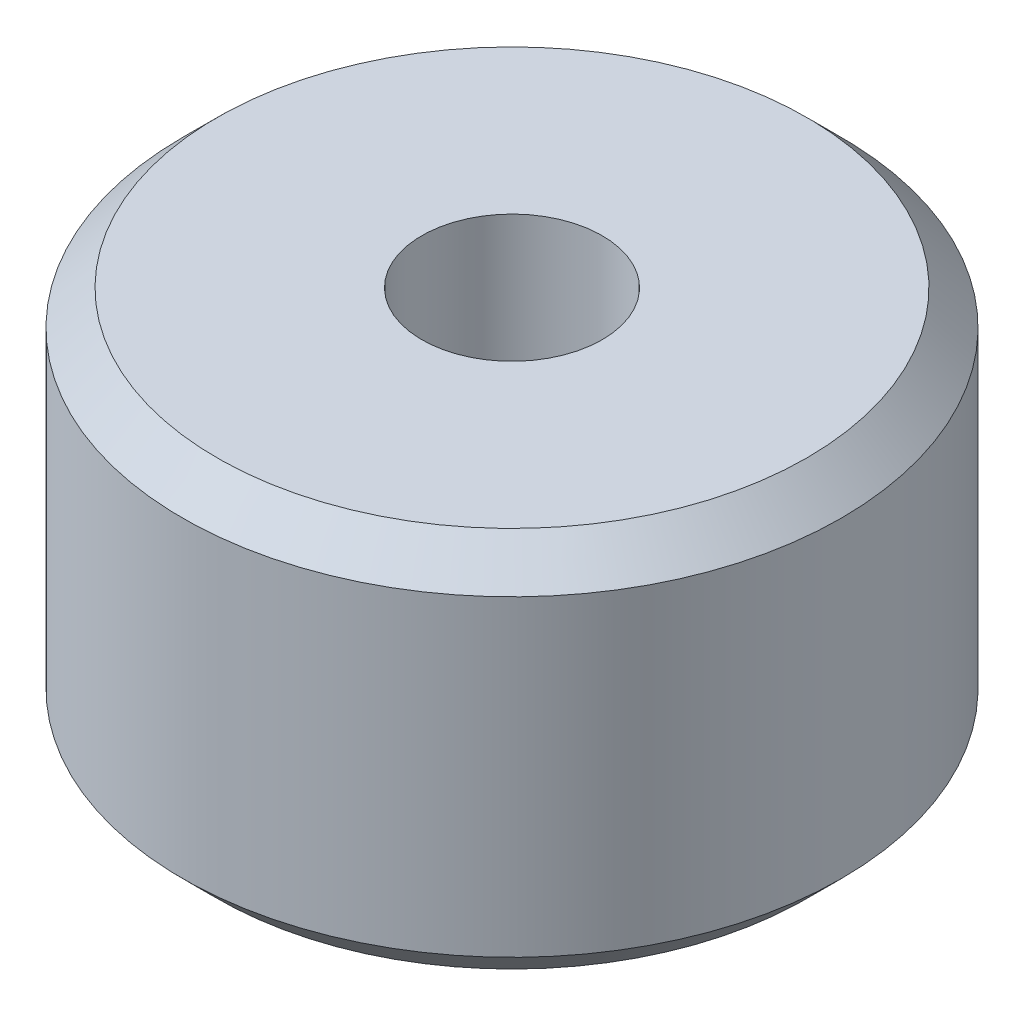
ISO-10303-21;
HEADER;
FILE_DESCRIPTION(('STEP AP214'),'2;1');
FILE_NAME('part.step','',(''),(''),'','','');
FILE_SCHEMA(('AUTOMOTIVE_DESIGN { 1 0 10303 214 1 1 1 1 }'));
ENDSEC;
DATA;
#1=APPLICATION_CONTEXT('core data for automotive mechanical design processes');
#2=APPLICATION_PROTOCOL_DEFINITION('international standard','automotive_design',2000,#1);
#3=PRODUCT_CONTEXT('',#1,'mechanical');
#4=PRODUCT('Part','Part','',(#3));
#5=PRODUCT_RELATED_PRODUCT_CATEGORY('part','',(#4));
#6=PRODUCT_DEFINITION_FORMATION('','',#4);
#7=PRODUCT_DEFINITION_CONTEXT('part definition',#1,'design');
#8=PRODUCT_DEFINITION('design','',#6,#7);
#9=PRODUCT_DEFINITION_SHAPE('','',#8);
#10=(LENGTH_UNIT() NAMED_UNIT(*) SI_UNIT(.MILLI.,.METRE.));
#11=(NAMED_UNIT(*) PLANE_ANGLE_UNIT() SI_UNIT($,.RADIAN.));
#12=(NAMED_UNIT(*) SI_UNIT($,.STERADIAN.) SOLID_ANGLE_UNIT());
#13=UNCERTAINTY_MEASURE_WITH_UNIT(LENGTH_MEASURE(1.E-05),#10,'distance_accuracy_value','');
#14=(GEOMETRIC_REPRESENTATION_CONTEXT(3) GLOBAL_UNCERTAINTY_ASSIGNED_CONTEXT((#13)) GLOBAL_UNIT_ASSIGNED_CONTEXT((#10,
#11,#12)) REPRESENTATION_CONTEXT('',''));
#15=CARTESIAN_POINT('',(0.,0.,0.));
#16=DIRECTION('',(0.,0.,1.));
#17=DIRECTION('',(1.,0.,0.));
#18=AXIS2_PLACEMENT_3D('',#15,#16,#17);
#19=CARTESIAN_POINT('',(-2.6,7.,0.));
#20=DIRECTION('',(0.,1.,0.));
#21=DIRECTION('',(-1.,0.,0.));
#22=AXIS2_PLACEMENT_3D('',#19,#20,#21);
#23=PLANE('',#22);
#24=CARTESIAN_POINT('',(0.,7.,0.));
#25=DIRECTION('',(0.,-1.,0.));
#26=DIRECTION('',(1.,0.,0.));
#27=AXIS2_PLACEMENT_3D('',#24,#25,#26);
#28=CIRCLE('',#27,5.05);
#29=CARTESIAN_POINT('',(5.05,7.,0.));
#30=VERTEX_POINT('',#29);
#31=EDGE_CURVE('E17',#30,#30,#28,.T.);
#32=ORIENTED_EDGE('',*,*,#31,.T.);
#33=EDGE_LOOP('',(#32));
#34=FACE_BOUND('',#33,.T.);
#35=CARTESIAN_POINT('',(0.,7.,0.));
#36=DIRECTION('',(0.,-1.,0.));
#37=DIRECTION('',(1.,0.,0.));
#38=AXIS2_PLACEMENT_3D('',#35,#36,#37);
#39=CIRCLE('',#38,2.6);
#40=CARTESIAN_POINT('',(2.6,7.,0.));
#41=VERTEX_POINT('',#40);
#42=EDGE_CURVE('E33',#41,#41,#39,.F.);
#43=ORIENTED_EDGE('',*,*,#42,.T.);
#44=EDGE_LOOP('',(#43));
#45=FACE_BOUND('',#44,.T.);
#46=ADVANCED_FACE('F14',(#34,#45),#23,.F.);
#47=CARTESIAN_POINT('',(0.,0.,0.));
#48=DIRECTION('',(0.,-1.,0.));
#49=DIRECTION('',(1.,0.,0.));
#50=AXIS2_PLACEMENT_3D('',#47,#48,#49);
#51=CYLINDRICAL_SURFACE('',#50,5.05);
#52=CARTESIAN_POINT('',(0.,0.999999999919511,0.));
#53=DIRECTION('',(0.,-1.,0.));
#54=DIRECTION('',(1.,0.,0.));
#55=AXIS2_PLACEMENT_3D('',#52,#53,#54);
#56=CIRCLE('',#55,5.0499999999829);
#57=CARTESIAN_POINT('',(5.0499999999829,0.99999999991951,0.));
#58=VERTEX_POINT('',#57);
#59=EDGE_CURVE('E29',#58,#58,#56,.T.);
#60=ORIENTED_EDGE('',*,*,#59,.T.);
#61=EDGE_LOOP('',(#60));
#62=FACE_BOUND('',#61,.T.);
#63=ORIENTED_EDGE('',*,*,#31,.F.);
#64=EDGE_LOOP('',(#63));
#65=FACE_BOUND('',#64,.T.);
#66=ADVANCED_FACE('F50',(#62,#65),#51,.F.);
#67=CARTESIAN_POINT('',(0.,0.,0.));
#68=DIRECTION('',(0.,-1.,0.));
#69=DIRECTION('',(1.,0.,0.));
#70=AXIS2_PLACEMENT_3D('',#67,#68,#69);
#71=CYLINDRICAL_SURFACE('',#70,2.6);
#72=CARTESIAN_POINT('',(0.,11.,0.));
#73=DIRECTION('',(0.,-1.,0.));
#74=DIRECTION('',(1.,0.,0.));
#75=AXIS2_PLACEMENT_3D('',#72,#73,#74);
#76=CIRCLE('',#75,2.6);
#77=CARTESIAN_POINT('',(2.6,11.,0.));
#78=VERTEX_POINT('',#77);
#79=EDGE_CURVE('E32',#78,#78,#76,.F.);
#80=ORIENTED_EDGE('',*,*,#79,.T.);
#81=EDGE_LOOP('',(#80));
#82=FACE_BOUND('',#81,.T.);
#83=ORIENTED_EDGE('',*,*,#42,.F.);
#84=EDGE_LOOP('',(#83));
#85=FACE_BOUND('',#84,.T.);
#86=ADVANCED_FACE('F52',(#82,#85),#71,.F.);
#87=CARTESIAN_POINT('',(0.,0.,0.));
#88=DIRECTION('',(0.,-1.,0.));
#89=DIRECTION('',(1.,0.,0.));
#90=AXIS2_PLACEMENT_3D('',#87,#88,#89);
#91=CONICAL_SURFACE('',#90,6.04999999990241,0.785398163369027);
#92=CARTESIAN_POINT('',(0.,-5.68416130742208E-11,0.));
#93=DIRECTION('',(0.,-1.,0.));
#94=DIRECTION('',(1.,0.,0.));
#95=AXIS2_PLACEMENT_3D('',#92,#93,#94);
#96=CIRCLE('',#95,6.04999999995925);
#97=CARTESIAN_POINT('',(6.04999999995925,-5.684255149907E-11,0.));
#98=VERTEX_POINT('',#97);
#99=EDGE_CURVE('E39',#98,#98,#96,.T.);
#100=ORIENTED_EDGE('',*,*,#99,.T.);
#101=EDGE_LOOP('',(#100));
#102=FACE_BOUND('',#101,.T.);
#103=ORIENTED_EDGE('',*,*,#59,.F.);
#104=EDGE_LOOP('',(#103));
#105=FACE_BOUND('',#104,.T.);
#106=ADVANCED_FACE('F59',(#102,#105),#91,.F.);
#107=CARTESIAN_POINT('',(-9.5,11.,0.));
#108=DIRECTION('',(0.,-1.,0.));
#109=DIRECTION('',(1.,0.,0.));
#110=AXIS2_PLACEMENT_3D('',#107,#108,#109);
#111=PLANE('',#110);
#112=ORIENTED_EDGE('',*,*,#79,.F.);
#113=EDGE_LOOP('',(#112));
#114=FACE_BOUND('',#113,.T.);
#115=CARTESIAN_POINT('',(0.,11.,0.));
#116=DIRECTION('',(0.,-1.,0.));
#117=DIRECTION('',(1.,0.,0.));
#118=AXIS2_PLACEMENT_3D('',#115,#116,#117);
#119=CIRCLE('',#118,8.49999999999999);
#120=CARTESIAN_POINT('',(8.49999999999999,11.,0.));
#121=VERTEX_POINT('',#120);
#122=EDGE_CURVE('E36',#121,#121,#119,.T.);
#123=ORIENTED_EDGE('',*,*,#122,.F.);
#124=EDGE_LOOP('',(#123));
#125=FACE_BOUND('',#124,.T.);
#126=ADVANCED_FACE('F80',(#114,#125),#111,.F.);
#127=CARTESIAN_POINT('',(-5.05,0.,0.));
#128=DIRECTION('',(0.,1.,0.));
#129=DIRECTION('',(-1.,0.,0.));
#130=AXIS2_PLACEMENT_3D('',#127,#128,#129);
#131=PLANE('',#130);
#132=ORIENTED_EDGE('',*,*,#99,.F.);
#133=EDGE_LOOP('',(#132));
#134=FACE_BOUND('',#133,.T.);
#135=CARTESIAN_POINT('',(0.,0.,0.));
#136=DIRECTION('',(0.,1.,0.));
#137=DIRECTION('',(-1.,0.,0.));
#138=AXIS2_PLACEMENT_3D('',#135,#136,#137);
#139=CIRCLE('',#138,8.49999999999999);
#140=CARTESIAN_POINT('',(-8.49999999999999,0.,0.));
#141=VERTEX_POINT('',#140);
#142=EDGE_CURVE('E26',#141,#141,#139,.T.);
#143=ORIENTED_EDGE('',*,*,#142,.F.);
#144=EDGE_LOOP('',(#143));
#145=FACE_BOUND('',#144,.T.);
#146=ADVANCED_FACE('F76',(#134,#145),#131,.F.);
#147=CARTESIAN_POINT('',(0.,9.99999999999999,0.));
#148=DIRECTION('',(0.,-1.,0.));
#149=DIRECTION('',(1.,0.,0.));
#150=AXIS2_PLACEMENT_3D('',#147,#148,#149);
#151=CONICAL_SURFACE('',#150,9.5,0.785398163397451);
#152=CARTESIAN_POINT('',(0.,9.99999999999999,0.));
#153=DIRECTION('',(0.,-1.,0.));
#154=DIRECTION('',(1.,0.,0.));
#155=AXIS2_PLACEMENT_3D('',#152,#153,#154);
#156=CIRCLE('',#155,9.5);
#157=CARTESIAN_POINT('',(9.5,9.99999999999999,0.));
#158=VERTEX_POINT('',#157);
#159=EDGE_CURVE('E21',#158,#158,#156,.T.);
#160=ORIENTED_EDGE('',*,*,#159,.F.);
#161=EDGE_LOOP('',(#160));
#162=FACE_BOUND('',#161,.T.);
#163=ORIENTED_EDGE('',*,*,#122,.T.);
#164=EDGE_LOOP('',(#163));
#165=FACE_BOUND('',#164,.T.);
#166=ADVANCED_FACE('F69',(#162,#165),#151,.T.);
#167=CARTESIAN_POINT('',(0.,1.00000000000001,0.));
#168=DIRECTION('',(0.,1.,0.));
#169=DIRECTION('',(-1.,0.,0.));
#170=AXIS2_PLACEMENT_3D('',#167,#168,#169);
#171=CONICAL_SURFACE('',#170,9.5,0.785398163397446);
#172=CARTESIAN_POINT('',(0.,1.00000000000001,0.));
#173=DIRECTION('',(0.,-1.,0.));
#174=DIRECTION('',(1.,0.,0.));
#175=AXIS2_PLACEMENT_3D('',#172,#173,#174);
#176=CIRCLE('',#175,9.5);
#177=CARTESIAN_POINT('',(9.5,1.00000000000001,0.));
#178=VERTEX_POINT('',#177);
#179=EDGE_CURVE('E10',#178,#178,#176,.F.);
#180=ORIENTED_EDGE('',*,*,#179,.F.);
#181=EDGE_LOOP('',(#180));
#182=FACE_BOUND('',#181,.T.);
#183=ORIENTED_EDGE('',*,*,#142,.T.);
#184=EDGE_LOOP('',(#183));
#185=FACE_BOUND('',#184,.T.);
#186=ADVANCED_FACE('F64',(#182,#185),#171,.T.);
#187=CARTESIAN_POINT('',(0.,0.,0.));
#188=DIRECTION('',(0.,-1.,0.));
#189=DIRECTION('',(1.,0.,0.));
#190=AXIS2_PLACEMENT_3D('',#187,#188,#189);
#191=CYLINDRICAL_SURFACE('',#190,9.5);
#192=ORIENTED_EDGE('',*,*,#179,.T.);
#193=EDGE_LOOP('',(#192));
#194=FACE_BOUND('',#193,.T.);
#195=ORIENTED_EDGE('',*,*,#159,.T.);
#196=EDGE_LOOP('',(#195));
#197=FACE_BOUND('',#196,.T.);
#198=ADVANCED_FACE('F62',(#194,#197),#191,.T.);
#199=CLOSED_SHELL('',(#46,#66,#86,#106,#126,#146,#166,#186,#198));
#200=MANIFOLD_SOLID_BREP('B1',#199);
#201=ADVANCED_BREP_SHAPE_REPRESENTATION('',(#18,#200),#14);
#202=SHAPE_DEFINITION_REPRESENTATION(#9,#201);
ENDSEC;
END-ISO-10303-21;
